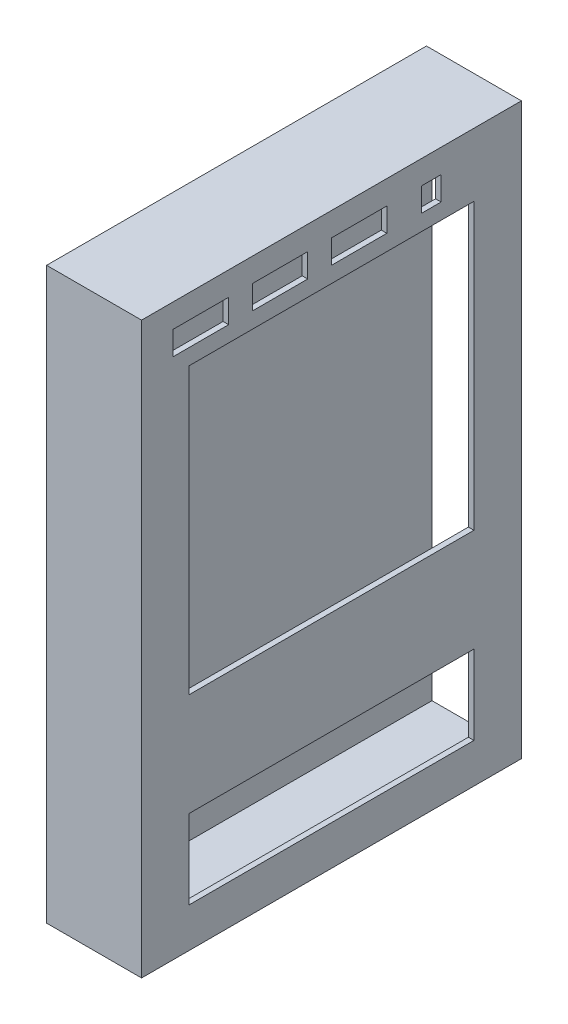
ISO-10303-21;
HEADER;
FILE_DESCRIPTION(('STEP AP214'),'2;1');
FILE_NAME('part.step','',(''),(''),'','','');
FILE_SCHEMA(('AUTOMOTIVE_DESIGN { 1 0 10303 214 1 1 1 1 }'));
ENDSEC;
DATA;
#1=APPLICATION_CONTEXT('core data for automotive mechanical design processes');
#2=APPLICATION_PROTOCOL_DEFINITION('international standard','automotive_design',2000,#1);
#3=PRODUCT_CONTEXT('',#1,'mechanical');
#4=PRODUCT('Part','Part','',(#3));
#5=PRODUCT_RELATED_PRODUCT_CATEGORY('part','',(#4));
#6=PRODUCT_DEFINITION_FORMATION('','',#4);
#7=PRODUCT_DEFINITION_CONTEXT('part definition',#1,'design');
#8=PRODUCT_DEFINITION('design','',#6,#7);
#9=PRODUCT_DEFINITION_SHAPE('','',#8);
#10=(LENGTH_UNIT() NAMED_UNIT(*) SI_UNIT(.MILLI.,.METRE.));
#11=(NAMED_UNIT(*) PLANE_ANGLE_UNIT() SI_UNIT($,.RADIAN.));
#12=(NAMED_UNIT(*) SI_UNIT($,.STERADIAN.) SOLID_ANGLE_UNIT());
#13=UNCERTAINTY_MEASURE_WITH_UNIT(LENGTH_MEASURE(1.E-05),#10,'distance_accuracy_value','');
#14=(GEOMETRIC_REPRESENTATION_CONTEXT(3) GLOBAL_UNCERTAINTY_ASSIGNED_CONTEXT((#13)) GLOBAL_UNIT_ASSIGNED_CONTEXT((#10,
#11,#12)) REPRESENTATION_CONTEXT('',''));
#15=CARTESIAN_POINT('',(0.,0.,0.));
#16=DIRECTION('',(0.,0.,1.));
#17=DIRECTION('',(1.,0.,0.));
#18=AXIS2_PLACEMENT_3D('',#15,#16,#17);
#19=CARTESIAN_POINT('',(-152.4,0.,-304.8));
#20=DIRECTION('',(0.,0.,-1.));
#21=DIRECTION('',(-1.,0.,0.));
#22=AXIS2_PLACEMENT_3D('',#19,#20,#21);
#23=PLANE('',#22);
#24=DIRECTION('',(0.,1.,0.));
#25=VECTOR('',#24,1.);
#26=CARTESIAN_POINT('',(0.,0.,-304.8));
#27=LINE('',#26,#25);
#28=CARTESIAN_POINT('',(0.,0.,-304.8));
#29=VERTEX_POINT('',#28);
#30=CARTESIAN_POINT('',(0.,914.4,-304.8));
#31=VERTEX_POINT('',#30);
#32=EDGE_CURVE('E591',#29,#31,#27,.T.);
#33=ORIENTED_EDGE('',*,*,#32,.F.);
#34=DIRECTION('',(1.,0.,0.));
#35=VECTOR('',#34,1.);
#36=CARTESIAN_POINT('',(-152.4,0.,-304.8));
#37=LINE('',#36,#35);
#38=CARTESIAN_POINT('',(-152.4,0.,-304.8));
#39=VERTEX_POINT('',#38);
#40=EDGE_CURVE('E599',#39,#29,#37,.T.);
#41=ORIENTED_EDGE('',*,*,#40,.F.);
#42=DIRECTION('',(0.,1.,0.));
#43=VECTOR('',#42,1.);
#44=CARTESIAN_POINT('',(-152.4,0.,-304.8));
#45=LINE('',#44,#43);
#46=CARTESIAN_POINT('',(-152.4,914.4,-304.8));
#47=VERTEX_POINT('',#46);
#48=EDGE_CURVE('E576',#39,#47,#45,.T.);
#49=ORIENTED_EDGE('',*,*,#48,.T.);
#50=DIRECTION('',(1.,0.,0.));
#51=VECTOR('',#50,1.);
#52=CARTESIAN_POINT('',(-152.4,914.4,-304.8));
#53=LINE('',#52,#51);
#54=EDGE_CURVE('E53',#47,#31,#53,.T.);
#55=ORIENTED_EDGE('',*,*,#54,.T.);
#56=EDGE_LOOP('',(#33,#41,#49,#55));
#57=FACE_BOUND('',#56,.T.);
#58=DIRECTION('',(1.,0.,0.));
#59=VECTOR('',#58,1.);
#60=CARTESIAN_POINT('',(-152.4,8.89,-304.8));
#61=LINE('',#60,#59);
#62=CARTESIAN_POINT('',(-143.51,8.89,-304.8));
#63=VERTEX_POINT('',#62);
#64=CARTESIAN_POINT('',(-8.89,8.89,-304.8));
#65=VERTEX_POINT('',#64);
#66=EDGE_CURVE('E540',#63,#65,#61,.T.);
#67=ORIENTED_EDGE('',*,*,#66,.T.);
#68=DIRECTION('',(0.,1.,0.));
#69=VECTOR('',#68,1.);
#70=CARTESIAN_POINT('',(-8.89000000000001,0.,-304.8));
#71=LINE('',#70,#69);
#72=CARTESIAN_POINT('',(-8.89,905.51,-304.8));
#73=VERTEX_POINT('',#72);
#74=EDGE_CURVE('E545',#65,#73,#71,.T.);
#75=ORIENTED_EDGE('',*,*,#74,.T.);
#76=DIRECTION('',(1.,0.,0.));
#77=VECTOR('',#76,1.);
#78=CARTESIAN_POINT('',(-152.4,905.51,-304.8));
#79=LINE('',#78,#77);
#80=CARTESIAN_POINT('',(-143.51,905.51,-304.8));
#81=VERTEX_POINT('',#80);
#82=EDGE_CURVE('E530',#81,#73,#79,.T.);
#83=ORIENTED_EDGE('',*,*,#82,.F.);
#84=DIRECTION('',(0.,1.,0.));
#85=VECTOR('',#84,1.);
#86=CARTESIAN_POINT('',(-143.51,0.,-304.8));
#87=LINE('',#86,#85);
#88=EDGE_CURVE('E549',#63,#81,#87,.T.);
#89=ORIENTED_EDGE('',*,*,#88,.F.);
#90=EDGE_LOOP('',(#67,#75,#83,#89));
#91=FACE_BOUND('',#90,.T.);
#92=ADVANCED_FACE('F43',(#57,#91),#23,.T.);
#93=CARTESIAN_POINT('',(-152.4,0.,304.8));
#94=DIRECTION('',(0.,0.,1.));
#95=DIRECTION('',(1.,0.,0.));
#96=AXIS2_PLACEMENT_3D('',#93,#94,#95);
#97=PLANE('',#96);
#98=DIRECTION('',(0.,-1.,0.));
#99=VECTOR('',#98,1.);
#100=CARTESIAN_POINT('',(0.,0.,304.8));
#101=LINE('',#100,#99);
#102=CARTESIAN_POINT('',(0.,914.4,304.8));
#103=VERTEX_POINT('',#102);
#104=CARTESIAN_POINT('',(0.,0.,304.8));
#105=VERTEX_POINT('',#104);
#106=EDGE_CURVE('E529',#103,#105,#101,.T.);
#107=ORIENTED_EDGE('',*,*,#106,.F.);
#108=DIRECTION('',(1.,0.,0.));
#109=VECTOR('',#108,1.);
#110=CARTESIAN_POINT('',(-152.4,914.4,304.8));
#111=LINE('',#110,#109);
#112=CARTESIAN_POINT('',(-152.4,914.4,304.8));
#113=VERTEX_POINT('',#112);
#114=EDGE_CURVE('E11',#113,#103,#111,.T.);
#115=ORIENTED_EDGE('',*,*,#114,.F.);
#116=DIRECTION('',(0.,-1.,0.));
#117=VECTOR('',#116,1.);
#118=CARTESIAN_POINT('',(-152.4,0.,304.8));
#119=LINE('',#118,#117);
#120=CARTESIAN_POINT('',(-152.4,0.,304.8));
#121=VERTEX_POINT('',#120);
#122=EDGE_CURVE('E567',#113,#121,#119,.T.);
#123=ORIENTED_EDGE('',*,*,#122,.T.);
#124=DIRECTION('',(1.,0.,0.));
#125=VECTOR('',#124,1.);
#126=CARTESIAN_POINT('',(-152.4,0.,304.8));
#127=LINE('',#126,#125);
#128=EDGE_CURVE('E47',#121,#105,#127,.T.);
#129=ORIENTED_EDGE('',*,*,#128,.T.);
#130=EDGE_LOOP('',(#107,#115,#123,#129));
#131=FACE_BOUND('',#130,.T.);
#132=ADVANCED_FACE('F45',(#131),#97,.T.);
#133=CARTESIAN_POINT('',(-152.4,914.4,304.8));
#134=DIRECTION('',(0.,1.,0.));
#135=DIRECTION('',(0.,0.,1.));
#136=AXIS2_PLACEMENT_3D('',#133,#134,#135);
#137=PLANE('',#136);
#138=DIRECTION('',(0.,0.,1.));
#139=VECTOR('',#138,1.);
#140=CARTESIAN_POINT('',(0.,914.4,304.8));
#141=LINE('',#140,#139);
#142=EDGE_CURVE('E572',#31,#103,#141,.T.);
#143=ORIENTED_EDGE('',*,*,#142,.F.);
#144=ORIENTED_EDGE('',*,*,#54,.F.);
#145=DIRECTION('',(0.,0.,1.));
#146=VECTOR('',#145,1.);
#147=CARTESIAN_POINT('',(-152.4,914.4,304.8));
#148=LINE('',#147,#146);
#149=EDGE_CURVE('E580',#47,#113,#148,.T.);
#150=ORIENTED_EDGE('',*,*,#149,.T.);
#151=ORIENTED_EDGE('',*,*,#114,.T.);
#152=EDGE_LOOP('',(#143,#144,#150,#151));
#153=FACE_BOUND('',#152,.T.);
#154=ADVANCED_FACE('F614',(#153),#137,.T.);
#155=CARTESIAN_POINT('',(-152.4,0.,304.8));
#156=DIRECTION('',(0.,-1.,0.));
#157=DIRECTION('',(0.,0.,-1.));
#158=AXIS2_PLACEMENT_3D('',#155,#156,#157);
#159=PLANE('',#158);
#160=DIRECTION('',(0.,0.,-1.));
#161=VECTOR('',#160,1.);
#162=CARTESIAN_POINT('',(0.,0.,304.8));
#163=LINE('',#162,#161);
#164=EDGE_CURVE('E587',#105,#29,#163,.T.);
#165=ORIENTED_EDGE('',*,*,#164,.F.);
#166=ORIENTED_EDGE('',*,*,#128,.F.);
#167=DIRECTION('',(0.,0.,-1.));
#168=VECTOR('',#167,1.);
#169=CARTESIAN_POINT('',(-152.4,0.,304.8));
#170=LINE('',#169,#168);
#171=EDGE_CURVE('E571',#121,#39,#170,.T.);
#172=ORIENTED_EDGE('',*,*,#171,.T.);
#173=ORIENTED_EDGE('',*,*,#40,.T.);
#174=EDGE_LOOP('',(#165,#166,#172,#173));
#175=FACE_BOUND('',#174,.T.);
#176=ADVANCED_FACE('F609',(#175),#159,.T.);
#177=CARTESIAN_POINT('',(-152.4,0.,0.));
#178=DIRECTION('',(-1.,0.,0.));
#179=DIRECTION('',(0.,0.,1.));
#180=AXIS2_PLACEMENT_3D('',#177,#178,#179);
#181=PLANE('',#180);
#182=ORIENTED_EDGE('',*,*,#122,.F.);
#183=ORIENTED_EDGE('',*,*,#149,.F.);
#184=ORIENTED_EDGE('',*,*,#48,.F.);
#185=ORIENTED_EDGE('',*,*,#171,.F.);
#186=EDGE_LOOP('',(#182,#183,#184,#185));
#187=FACE_BOUND('',#186,.T.);
#188=ADVANCED_FACE('F617',(#187),#181,.T.);
#189=CARTESIAN_POINT('',(0.,0.,0.));
#190=DIRECTION('',(-1.,0.,0.));
#191=DIRECTION('',(0.,0.,1.));
#192=AXIS2_PLACEMENT_3D('',#189,#190,#191);
#193=PLANE('',#192);
#194=DIRECTION('',(0.,1.,0.));
#195=VECTOR('',#194,1.);
#196=CARTESIAN_POINT('',(0.,838.2,165.1));
#197=LINE('',#196,#195);
#198=CARTESIAN_POINT('',(0.,838.2,165.1));
#199=VERTEX_POINT('',#198);
#200=CARTESIAN_POINT('',(0.,876.3,165.1));
#201=VERTEX_POINT('',#200);
#202=EDGE_CURVE('E284',#199,#201,#197,.T.);
#203=ORIENTED_EDGE('',*,*,#202,.F.);
#204=DIRECTION('',(0.,0.,-1.));
#205=VECTOR('',#204,1.);
#206=CARTESIAN_POINT('',(0.,838.2,254.));
#207=LINE('',#206,#205);
#208=CARTESIAN_POINT('',(0.,838.2,254.));
#209=VERTEX_POINT('',#208);
#210=EDGE_CURVE('E274',#209,#199,#207,.T.);
#211=ORIENTED_EDGE('',*,*,#210,.F.);
#212=DIRECTION('',(0.,-1.,0.));
#213=VECTOR('',#212,1.);
#214=CARTESIAN_POINT('',(0.,838.2,254.));
#215=LINE('',#214,#213);
#216=CARTESIAN_POINT('',(0.,876.3,254.));
#217=VERTEX_POINT('',#216);
#218=EDGE_CURVE('E288',#217,#209,#215,.T.);
#219=ORIENTED_EDGE('',*,*,#218,.F.);
#220=DIRECTION('',(0.,0.,1.));
#221=VECTOR('',#220,1.);
#222=CARTESIAN_POINT('',(0.,876.3,254.));
#223=LINE('',#222,#221);
#224=EDGE_CURVE('E61',#201,#217,#223,.T.);
#225=ORIENTED_EDGE('',*,*,#224,.F.);
#226=EDGE_LOOP('',(#203,#211,#219,#225));
#227=FACE_BOUND('',#226,.T.);
#228=DIRECTION('',(0.,0.,1.));
#229=VECTOR('',#228,1.);
#230=CARTESIAN_POINT('',(0.,876.3,0.));
#231=LINE('',#230,#229);
#232=CARTESIAN_POINT('',(0.,876.3,-88.8999999999999));
#233=VERTEX_POINT('',#232);
#234=CARTESIAN_POINT('',(0.,876.3,0.));
#235=VERTEX_POINT('',#234);
#236=EDGE_CURVE('E341',#233,#235,#231,.T.);
#237=ORIENTED_EDGE('',*,*,#236,.F.);
#238=DIRECTION('',(0.,1.,0.));
#239=VECTOR('',#238,1.);
#240=CARTESIAN_POINT('',(0.,838.2,-88.8999999999999));
#241=LINE('',#240,#239);
#242=CARTESIAN_POINT('',(0.,838.2,-88.8999999999999));
#243=VERTEX_POINT('',#242);
#244=EDGE_CURVE('E337',#243,#233,#241,.T.);
#245=ORIENTED_EDGE('',*,*,#244,.F.);
#246=DIRECTION('',(0.,0.,-1.));
#247=VECTOR('',#246,1.);
#248=CARTESIAN_POINT('',(0.,838.2,0.));
#249=LINE('',#248,#247);
#250=CARTESIAN_POINT('',(0.,838.2,0.));
#251=VERTEX_POINT('',#250);
#252=EDGE_CURVE('E332',#251,#243,#249,.T.);
#253=ORIENTED_EDGE('',*,*,#252,.F.);
#254=DIRECTION('',(0.,-1.,0.));
#255=VECTOR('',#254,1.);
#256=CARTESIAN_POINT('',(0.,838.2,0.));
#257=LINE('',#256,#255);
#258=EDGE_CURVE('E69',#235,#251,#257,.T.);
#259=ORIENTED_EDGE('',*,*,#258,.F.);
#260=EDGE_LOOP('',(#237,#245,#253,#259));
#261=FACE_BOUND('',#260,.T.);
#262=DIRECTION('',(0.,1.,0.));
#263=VECTOR('',#262,1.);
#264=CARTESIAN_POINT('',(0.,838.2,-175.901262688416));
#265=LINE('',#264,#263);
#266=CARTESIAN_POINT('',(0.,838.2,-175.901262688416));
#267=VERTEX_POINT('',#266);
#268=CARTESIAN_POINT('',(0.,876.3,-175.901262688416));
#269=VERTEX_POINT('',#268);
#270=EDGE_CURVE('E428',#267,#269,#265,.T.);
#271=ORIENTED_EDGE('',*,*,#270,.F.);
#272=DIRECTION('',(0.,0.,-1.));
#273=VECTOR('',#272,1.);
#274=CARTESIAN_POINT('',(0.,838.2,-144.151262688416));
#275=LINE('',#274,#273);
#276=CARTESIAN_POINT('',(0.,838.2,-144.151262688416));
#277=VERTEX_POINT('',#276);
#278=EDGE_CURVE('E424',#277,#267,#275,.T.);
#279=ORIENTED_EDGE('',*,*,#278,.F.);
#280=DIRECTION('',(0.,-1.,0.));
#281=VECTOR('',#280,1.);
#282=CARTESIAN_POINT('',(0.,838.2,-144.151262688416));
#283=LINE('',#282,#281);
#284=CARTESIAN_POINT('',(0.,876.3,-144.151262688416));
#285=VERTEX_POINT('',#284);
#286=EDGE_CURVE('E351',#285,#277,#283,.T.);
#287=ORIENTED_EDGE('',*,*,#286,.F.);
#288=DIRECTION('',(0.,0.,1.));
#289=VECTOR('',#288,1.);
#290=CARTESIAN_POINT('',(0.,876.3,-144.151262688416));
#291=LINE('',#290,#289);
#292=EDGE_CURVE('E420',#269,#285,#291,.T.);
#293=ORIENTED_EDGE('',*,*,#292,.F.);
#294=EDGE_LOOP('',(#271,#279,#287,#293));
#295=FACE_BOUND('',#294,.T.);
#296=DIRECTION('',(0.,0.,1.));
#297=VECTOR('',#296,1.);
#298=CARTESIAN_POINT('',(0.,876.3,127.));
#299=LINE('',#298,#297);
#300=CARTESIAN_POINT('',(0.,876.3,38.1000000000001));
#301=VERTEX_POINT('',#300);
#302=CARTESIAN_POINT('',(0.,876.3,127.));
#303=VERTEX_POINT('',#302);
#304=EDGE_CURVE('E386',#301,#303,#299,.T.);
#305=ORIENTED_EDGE('',*,*,#304,.F.);
#306=DIRECTION('',(0.,1.,0.));
#307=VECTOR('',#306,1.);
#308=CARTESIAN_POINT('',(0.,838.2,38.1000000000001));
#309=LINE('',#308,#307);
#310=CARTESIAN_POINT('',(0.,838.2,38.1000000000001));
#311=VERTEX_POINT('',#310);
#312=EDGE_CURVE('E382',#311,#301,#309,.T.);
#313=ORIENTED_EDGE('',*,*,#312,.F.);
#314=DIRECTION('',(0.,0.,-1.));
#315=VECTOR('',#314,1.);
#316=CARTESIAN_POINT('',(0.,838.2,127.));
#317=LINE('',#316,#315);
#318=CARTESIAN_POINT('',(0.,838.2,127.));
#319=VERTEX_POINT('',#318);
#320=EDGE_CURVE('E378',#319,#311,#317,.T.);
#321=ORIENTED_EDGE('',*,*,#320,.F.);
#322=DIRECTION('',(0.,-1.,0.));
#323=VECTOR('',#322,1.);
#324=CARTESIAN_POINT('',(0.,838.2,127.));
#325=LINE('',#324,#323);
#326=EDGE_CURVE('E377',#303,#319,#325,.T.);
#327=ORIENTED_EDGE('',*,*,#326,.F.);
#328=EDGE_LOOP('',(#305,#313,#321,#327));
#329=FACE_BOUND('',#328,.T.);
#330=DIRECTION('',(0.,1.,0.));
#331=VECTOR('',#330,1.);
#332=CARTESIAN_POINT('',(0.,812.8,-228.6));
#333=LINE('',#332,#331);
#334=CARTESIAN_POINT('',(0.,355.6,-228.6));
#335=VERTEX_POINT('',#334);
#336=CARTESIAN_POINT('',(0.,812.8,-228.6));
#337=VERTEX_POINT('',#336);
#338=EDGE_CURVE('E438',#335,#337,#333,.T.);
#339=ORIENTED_EDGE('',*,*,#338,.F.);
#340=DIRECTION('',(0.,0.,-1.));
#341=VECTOR('',#340,1.);
#342=CARTESIAN_POINT('',(0.,355.6,228.6));
#343=LINE('',#342,#341);
#344=CARTESIAN_POINT('',(0.,355.6,228.6));
#345=VERTEX_POINT('',#344);
#346=EDGE_CURVE('E442',#345,#335,#343,.T.);
#347=ORIENTED_EDGE('',*,*,#346,.F.);
#348=DIRECTION('',(0.,-1.,0.));
#349=VECTOR('',#348,1.);
#350=CARTESIAN_POINT('',(0.,812.8,228.6));
#351=LINE('',#350,#349);
#352=CARTESIAN_POINT('',(0.,812.8,228.6));
#353=VERTEX_POINT('',#352);
#354=EDGE_CURVE('E303',#353,#345,#351,.T.);
#355=ORIENTED_EDGE('',*,*,#354,.F.);
#356=DIRECTION('',(0.,0.,1.));
#357=VECTOR('',#356,1.);
#358=CARTESIAN_POINT('',(0.,812.8,228.6));
#359=LINE('',#358,#357);
#360=EDGE_CURVE('E434',#337,#353,#359,.T.);
#361=ORIENTED_EDGE('',*,*,#360,.F.);
#362=EDGE_LOOP('',(#339,#347,#355,#361));
#363=FACE_BOUND('',#362,.T.);
#364=DIRECTION('',(0.,1.,0.));
#365=VECTOR('',#364,1.);
#366=CARTESIAN_POINT('',(0.,63.5,-228.6));
#367=LINE('',#366,#365);
#368=CARTESIAN_POINT('',(0.,63.5,-228.6));
#369=VERTEX_POINT('',#368);
#370=CARTESIAN_POINT('',(0.,190.5,-228.6));
#371=VERTEX_POINT('',#370);
#372=EDGE_CURVE('E482',#369,#371,#367,.T.);
#373=ORIENTED_EDGE('',*,*,#372,.F.);
#374=DIRECTION('',(0.,0.,-1.));
#375=VECTOR('',#374,1.);
#376=CARTESIAN_POINT('',(0.,63.5,228.6));
#377=LINE('',#376,#375);
#378=CARTESIAN_POINT('',(0.,63.5,228.6));
#379=VERTEX_POINT('',#378);
#380=EDGE_CURVE('E486',#379,#369,#377,.T.);
#381=ORIENTED_EDGE('',*,*,#380,.F.);
#382=DIRECTION('',(0.,-1.,0.));
#383=VECTOR('',#382,1.);
#384=CARTESIAN_POINT('',(0.,63.5,228.6));
#385=LINE('',#384,#383);
#386=CARTESIAN_POINT('',(0.,190.5,228.6));
#387=VERTEX_POINT('',#386);
#388=EDGE_CURVE('E477',#387,#379,#385,.T.);
#389=ORIENTED_EDGE('',*,*,#388,.F.);
#390=DIRECTION('',(0.,0.,1.));
#391=VECTOR('',#390,1.);
#392=CARTESIAN_POINT('',(0.,190.5,228.6));
#393=LINE('',#392,#391);
#394=EDGE_CURVE('E478',#371,#387,#393,.T.);
#395=ORIENTED_EDGE('',*,*,#394,.F.);
#396=EDGE_LOOP('',(#373,#381,#389,#395));
#397=FACE_BOUND('',#396,.T.);
#398=ORIENTED_EDGE('',*,*,#106,.T.);
#399=ORIENTED_EDGE('',*,*,#164,.T.);
#400=ORIENTED_EDGE('',*,*,#32,.T.);
#401=ORIENTED_EDGE('',*,*,#142,.T.);
#402=EDGE_LOOP('',(#398,#399,#400,#401));
#403=FACE_BOUND('',#402,.T.);
#404=ADVANCED_FACE('F611',(#227,#261,#295,#329,#363,#397,#403),#193,.F.);
#405=CARTESIAN_POINT('',(-152.4,0.,295.91));
#406=DIRECTION('',(0.,0.,1.));
#407=DIRECTION('',(1.,0.,0.));
#408=AXIS2_PLACEMENT_3D('',#405,#406,#407);
#409=PLANE('',#408);
#410=DIRECTION('',(0.,-1.,0.));
#411=VECTOR('',#410,1.);
#412=CARTESIAN_POINT('',(-8.89000000000001,0.,295.91));
#413=LINE('',#412,#411);
#414=CARTESIAN_POINT('',(-8.89,905.51,295.91));
#415=VERTEX_POINT('',#414);
#416=CARTESIAN_POINT('',(-8.89,8.89,295.91));
#417=VERTEX_POINT('',#416);
#418=EDGE_CURVE('E521',#415,#417,#413,.T.);
#419=ORIENTED_EDGE('',*,*,#418,.T.);
#420=DIRECTION('',(1.,0.,0.));
#421=VECTOR('',#420,1.);
#422=CARTESIAN_POINT('',(-152.4,8.89,295.91));
#423=LINE('',#422,#421);
#424=CARTESIAN_POINT('',(-143.51,8.89,295.91));
#425=VERTEX_POINT('',#424);
#426=EDGE_CURVE('E537',#425,#417,#423,.T.);
#427=ORIENTED_EDGE('',*,*,#426,.F.);
#428=DIRECTION('',(0.,-1.,0.));
#429=VECTOR('',#428,1.);
#430=CARTESIAN_POINT('',(-143.51,0.,295.91));
#431=LINE('',#430,#429);
#432=CARTESIAN_POINT('',(-143.51,905.51,295.91));
#433=VERTEX_POINT('',#432);
#434=EDGE_CURVE('E531',#433,#425,#431,.T.);
#435=ORIENTED_EDGE('',*,*,#434,.F.);
#436=DIRECTION('',(1.,0.,0.));
#437=VECTOR('',#436,1.);
#438=CARTESIAN_POINT('',(-152.4,905.51,295.91));
#439=LINE('',#438,#437);
#440=EDGE_CURVE('E526',#433,#415,#439,.T.);
#441=ORIENTED_EDGE('',*,*,#440,.T.);
#442=EDGE_LOOP('',(#419,#427,#435,#441));
#443=FACE_BOUND('',#442,.T.);
#444=ADVANCED_FACE('F633',(#443),#409,.F.);
#445=CARTESIAN_POINT('',(-152.4,905.51,304.8));
#446=DIRECTION('',(0.,1.,0.));
#447=DIRECTION('',(0.,0.,1.));
#448=AXIS2_PLACEMENT_3D('',#445,#446,#447);
#449=PLANE('',#448);
#450=DIRECTION('',(0.,0.,1.));
#451=VECTOR('',#450,1.);
#452=CARTESIAN_POINT('',(-8.89000000000001,905.51,304.8));
#453=LINE('',#452,#451);
#454=EDGE_CURVE('E536',#73,#415,#453,.T.);
#455=ORIENTED_EDGE('',*,*,#454,.T.);
#456=ORIENTED_EDGE('',*,*,#440,.F.);
#457=DIRECTION('',(0.,0.,1.));
#458=VECTOR('',#457,1.);
#459=CARTESIAN_POINT('',(-143.51,905.51,304.8));
#460=LINE('',#459,#458);
#461=EDGE_CURVE('E541',#81,#433,#460,.T.);
#462=ORIENTED_EDGE('',*,*,#461,.F.);
#463=ORIENTED_EDGE('',*,*,#82,.T.);
#464=EDGE_LOOP('',(#455,#456,#462,#463));
#465=FACE_BOUND('',#464,.T.);
#466=ADVANCED_FACE('F638',(#465),#449,.F.);
#467=CARTESIAN_POINT('',(-152.4,8.89,304.8));
#468=DIRECTION('',(0.,-1.,0.));
#469=DIRECTION('',(0.,0.,-1.));
#470=AXIS2_PLACEMENT_3D('',#467,#468,#469);
#471=PLANE('',#470);
#472=DIRECTION('',(0.,0.,-1.));
#473=VECTOR('',#472,1.);
#474=CARTESIAN_POINT('',(-8.89000000000001,8.89,304.8));
#475=LINE('',#474,#473);
#476=EDGE_CURVE('E525',#417,#65,#475,.T.);
#477=ORIENTED_EDGE('',*,*,#476,.T.);
#478=ORIENTED_EDGE('',*,*,#66,.F.);
#479=DIRECTION('',(0.,0.,-1.));
#480=VECTOR('',#479,1.);
#481=CARTESIAN_POINT('',(-143.51,8.89,304.8));
#482=LINE('',#481,#480);
#483=EDGE_CURVE('E535',#425,#63,#482,.T.);
#484=ORIENTED_EDGE('',*,*,#483,.F.);
#485=ORIENTED_EDGE('',*,*,#426,.T.);
#486=EDGE_LOOP('',(#477,#478,#484,#485));
#487=FACE_BOUND('',#486,.T.);
#488=ADVANCED_FACE('F627',(#487),#471,.F.);
#489=CARTESIAN_POINT('',(-143.51,0.,0.));
#490=DIRECTION('',(-1.,0.,0.));
#491=DIRECTION('',(0.,0.,1.));
#492=AXIS2_PLACEMENT_3D('',#489,#490,#491);
#493=PLANE('',#492);
#494=ORIENTED_EDGE('',*,*,#434,.T.);
#495=ORIENTED_EDGE('',*,*,#483,.T.);
#496=ORIENTED_EDGE('',*,*,#88,.T.);
#497=ORIENTED_EDGE('',*,*,#461,.T.);
#498=EDGE_LOOP('',(#494,#495,#496,#497));
#499=FACE_BOUND('',#498,.T.);
#500=ADVANCED_FACE('F630',(#499),#493,.F.);
#501=CARTESIAN_POINT('',(-8.89,0.,0.));
#502=DIRECTION('',(-1.,0.,0.));
#503=DIRECTION('',(0.,0.,1.));
#504=AXIS2_PLACEMENT_3D('',#501,#502,#503);
#505=PLANE('',#504);
#506=DIRECTION('',(0.,0.,-1.));
#507=VECTOR('',#506,1.);
#508=CARTESIAN_POINT('',(-8.89,838.2,254.));
#509=LINE('',#508,#507);
#510=CARTESIAN_POINT('',(-8.89,838.2,254.));
#511=VERTEX_POINT('',#510);
#512=CARTESIAN_POINT('',(-8.89,838.2,165.1));
#513=VERTEX_POINT('',#512);
#514=EDGE_CURVE('E271',#511,#513,#509,.T.);
#515=ORIENTED_EDGE('',*,*,#514,.T.);
#516=DIRECTION('',(0.,1.,0.));
#517=VECTOR('',#516,1.);
#518=CARTESIAN_POINT('',(-8.89,838.2,165.1));
#519=LINE('',#518,#517);
#520=CARTESIAN_POINT('',(-8.89,876.3,165.1));
#521=VERTEX_POINT('',#520);
#522=EDGE_CURVE('E256',#513,#521,#519,.T.);
#523=ORIENTED_EDGE('',*,*,#522,.T.);
#524=DIRECTION('',(0.,0.,1.));
#525=VECTOR('',#524,1.);
#526=CARTESIAN_POINT('',(-8.89,876.3,254.));
#527=LINE('',#526,#525);
#528=CARTESIAN_POINT('',(-8.89,876.3,254.));
#529=VERTEX_POINT('',#528);
#530=EDGE_CURVE('E294',#521,#529,#527,.T.);
#531=ORIENTED_EDGE('',*,*,#530,.T.);
#532=DIRECTION('',(0.,-1.,0.));
#533=VECTOR('',#532,1.);
#534=CARTESIAN_POINT('',(-8.89,838.2,254.));
#535=LINE('',#534,#533);
#536=EDGE_CURVE('E280',#529,#511,#535,.T.);
#537=ORIENTED_EDGE('',*,*,#536,.T.);
#538=EDGE_LOOP('',(#515,#523,#531,#537));
#539=FACE_BOUND('',#538,.T.);
#540=DIRECTION('',(0.,1.,0.));
#541=VECTOR('',#540,1.);
#542=CARTESIAN_POINT('',(-8.89,838.2,-88.8999999999999));
#543=LINE('',#542,#541);
#544=CARTESIAN_POINT('',(-8.89,838.2,-88.8999999999999));
#545=VERTEX_POINT('',#544);
#546=CARTESIAN_POINT('',(-8.89,876.3,-88.8999999999999));
#547=VERTEX_POINT('',#546);
#548=EDGE_CURVE('E311',#545,#547,#543,.T.);
#549=ORIENTED_EDGE('',*,*,#548,.T.);
#550=DIRECTION('',(0.,0.,1.));
#551=VECTOR('',#550,1.);
#552=CARTESIAN_POINT('',(-8.89,876.3,0.));
#553=LINE('',#552,#551);
#554=CARTESIAN_POINT('',(-8.89,876.3,0.));
#555=VERTEX_POINT('',#554);
#556=EDGE_CURVE('E312',#547,#555,#553,.T.);
#557=ORIENTED_EDGE('',*,*,#556,.T.);
#558=DIRECTION('',(0.,-1.,0.));
#559=VECTOR('',#558,1.);
#560=CARTESIAN_POINT('',(-8.89,838.2,0.));
#561=LINE('',#560,#559);
#562=CARTESIAN_POINT('',(-8.89,838.2,0.));
#563=VERTEX_POINT('',#562);
#564=EDGE_CURVE('E316',#555,#563,#561,.T.);
#565=ORIENTED_EDGE('',*,*,#564,.T.);
#566=DIRECTION('',(0.,0.,-1.));
#567=VECTOR('',#566,1.);
#568=CARTESIAN_POINT('',(-8.89,838.2,0.));
#569=LINE('',#568,#567);
#570=EDGE_CURVE('E307',#563,#545,#569,.T.);
#571=ORIENTED_EDGE('',*,*,#570,.T.);
#572=EDGE_LOOP('',(#549,#557,#565,#571));
#573=FACE_BOUND('',#572,.T.);
#574=DIRECTION('',(0.,0.,-1.));
#575=VECTOR('',#574,1.);
#576=CARTESIAN_POINT('',(-8.89,838.2,-144.151262688416));
#577=LINE('',#576,#575);
#578=CARTESIAN_POINT('',(-8.89,838.2,-144.151262688416));
#579=VERTEX_POINT('',#578);
#580=CARTESIAN_POINT('',(-8.89,838.2,-175.901262688416));
#581=VERTEX_POINT('',#580);
#582=EDGE_CURVE('E398',#579,#581,#577,.T.);
#583=ORIENTED_EDGE('',*,*,#582,.T.);
#584=DIRECTION('',(0.,1.,0.));
#585=VECTOR('',#584,1.);
#586=CARTESIAN_POINT('',(-8.89,838.2,-175.901262688416));
#587=LINE('',#586,#585);
#588=CARTESIAN_POINT('',(-8.89,876.3,-175.901262688416));
#589=VERTEX_POINT('',#588);
#590=EDGE_CURVE('E399',#581,#589,#587,.T.);
#591=ORIENTED_EDGE('',*,*,#590,.T.);
#592=DIRECTION('',(0.,0.,1.));
#593=VECTOR('',#592,1.);
#594=CARTESIAN_POINT('',(-8.89,876.3,-144.151262688416));
#595=LINE('',#594,#593);
#596=CARTESIAN_POINT('',(-8.89,876.3,-144.151262688416));
#597=VERTEX_POINT('',#596);
#598=EDGE_CURVE('E403',#589,#597,#595,.T.);
#599=ORIENTED_EDGE('',*,*,#598,.T.);
#600=DIRECTION('',(0.,-1.,0.));
#601=VECTOR('',#600,1.);
#602=CARTESIAN_POINT('',(-8.89,838.2,-144.151262688416));
#603=LINE('',#602,#601);
#604=EDGE_CURVE('E394',#597,#579,#603,.T.);
#605=ORIENTED_EDGE('',*,*,#604,.T.);
#606=EDGE_LOOP('',(#583,#591,#599,#605));
#607=FACE_BOUND('',#606,.T.);
#608=DIRECTION('',(0.,1.,0.));
#609=VECTOR('',#608,1.);
#610=CARTESIAN_POINT('',(-8.89,838.2,38.1000000000001));
#611=LINE('',#610,#609);
#612=CARTESIAN_POINT('',(-8.89,838.2,38.1000000000001));
#613=VERTEX_POINT('',#612);
#614=CARTESIAN_POINT('',(-8.89,876.3,38.1000000000001));
#615=VERTEX_POINT('',#614);
#616=EDGE_CURVE('E355',#613,#615,#611,.T.);
#617=ORIENTED_EDGE('',*,*,#616,.T.);
#618=DIRECTION('',(0.,0.,1.));
#619=VECTOR('',#618,1.);
#620=CARTESIAN_POINT('',(-8.89,876.3,127.));
#621=LINE('',#620,#619);
#622=CARTESIAN_POINT('',(-8.89,876.3,127.));
#623=VERTEX_POINT('',#622);
#624=EDGE_CURVE('E356',#615,#623,#621,.T.);
#625=ORIENTED_EDGE('',*,*,#624,.T.);
#626=DIRECTION('',(0.,-1.,0.));
#627=VECTOR('',#626,1.);
#628=CARTESIAN_POINT('',(-8.89,838.2,127.));
#629=LINE('',#628,#627);
#630=CARTESIAN_POINT('',(-8.89,838.2,127.));
#631=VERTEX_POINT('',#630);
#632=EDGE_CURVE('E360',#623,#631,#629,.T.);
#633=ORIENTED_EDGE('',*,*,#632,.T.);
#634=DIRECTION('',(0.,0.,-1.));
#635=VECTOR('',#634,1.);
#636=CARTESIAN_POINT('',(-8.89,838.2,127.));
#637=LINE('',#636,#635);
#638=EDGE_CURVE('E350',#631,#613,#637,.T.);
#639=ORIENTED_EDGE('',*,*,#638,.T.);
#640=EDGE_LOOP('',(#617,#625,#633,#639));
#641=FACE_BOUND('',#640,.T.);
#642=DIRECTION('',(0.,0.,-1.));
#643=VECTOR('',#642,1.);
#644=CARTESIAN_POINT('',(-8.88999999999995,355.6,228.6));
#645=LINE('',#644,#643);
#646=CARTESIAN_POINT('',(-8.89,355.6,228.6));
#647=VERTEX_POINT('',#646);
#648=CARTESIAN_POINT('',(-8.88999999999995,355.6,-228.6));
#649=VERTEX_POINT('',#648);
#650=EDGE_CURVE('E437',#647,#649,#645,.T.);
#651=ORIENTED_EDGE('',*,*,#650,.T.);
#652=DIRECTION('',(0.,1.,0.));
#653=VECTOR('',#652,1.);
#654=CARTESIAN_POINT('',(-8.88999999999995,812.8,-228.6));
#655=LINE('',#654,#653);
#656=CARTESIAN_POINT('',(-8.88999999999995,812.8,-228.6));
#657=VERTEX_POINT('',#656);
#658=EDGE_CURVE('E464',#649,#657,#655,.T.);
#659=ORIENTED_EDGE('',*,*,#658,.T.);
#660=DIRECTION('',(0.,0.,1.));
#661=VECTOR('',#660,1.);
#662=CARTESIAN_POINT('',(-8.88999999999995,812.8,228.6));
#663=LINE('',#662,#661);
#664=CARTESIAN_POINT('',(-8.88999999999995,812.8,228.6));
#665=VERTEX_POINT('',#664);
#666=EDGE_CURVE('E459',#657,#665,#663,.T.);
#667=ORIENTED_EDGE('',*,*,#666,.T.);
#668=DIRECTION('',(0.,-1.,0.));
#669=VECTOR('',#668,1.);
#670=CARTESIAN_POINT('',(-8.88999999999995,812.8,228.6));
#671=LINE('',#670,#669);
#672=EDGE_CURVE('E453',#665,#647,#671,.T.);
#673=ORIENTED_EDGE('',*,*,#672,.T.);
#674=EDGE_LOOP('',(#651,#659,#667,#673));
#675=FACE_BOUND('',#674,.T.);
#676=DIRECTION('',(0.,0.,-1.));
#677=VECTOR('',#676,1.);
#678=CARTESIAN_POINT('',(-8.89000000000001,63.5,228.6));
#679=LINE('',#678,#677);
#680=CARTESIAN_POINT('',(-8.89,63.5,228.6));
#681=VERTEX_POINT('',#680);
#682=CARTESIAN_POINT('',(-8.89000000000001,63.5,-228.6));
#683=VERTEX_POINT('',#682);
#684=EDGE_CURVE('E481',#681,#683,#679,.T.);
#685=ORIENTED_EDGE('',*,*,#684,.T.);
#686=DIRECTION('',(0.,1.,0.));
#687=VECTOR('',#686,1.);
#688=CARTESIAN_POINT('',(-8.89000000000001,63.5,-228.6));
#689=LINE('',#688,#687);
#690=CARTESIAN_POINT('',(-8.89000000000001,190.5,-228.6));
#691=VERTEX_POINT('',#690);
#692=EDGE_CURVE('E508',#683,#691,#689,.T.);
#693=ORIENTED_EDGE('',*,*,#692,.T.);
#694=DIRECTION('',(0.,0.,1.));
#695=VECTOR('',#694,1.);
#696=CARTESIAN_POINT('',(-8.89000000000001,190.5,228.6));
#697=LINE('',#696,#695);
#698=CARTESIAN_POINT('',(-8.89000000000001,190.5,228.6));
#699=VERTEX_POINT('',#698);
#700=EDGE_CURVE('E503',#691,#699,#697,.T.);
#701=ORIENTED_EDGE('',*,*,#700,.T.);
#702=DIRECTION('',(0.,-1.,0.));
#703=VECTOR('',#702,1.);
#704=CARTESIAN_POINT('',(-8.89000000000001,63.5,228.6));
#705=LINE('',#704,#703);
#706=EDGE_CURVE('E497',#699,#681,#705,.T.);
#707=ORIENTED_EDGE('',*,*,#706,.T.);
#708=EDGE_LOOP('',(#685,#693,#701,#707));
#709=FACE_BOUND('',#708,.T.);
#710=ORIENTED_EDGE('',*,*,#418,.F.);
#711=ORIENTED_EDGE('',*,*,#454,.F.);
#712=ORIENTED_EDGE('',*,*,#74,.F.);
#713=ORIENTED_EDGE('',*,*,#476,.F.);
#714=EDGE_LOOP('',(#710,#711,#712,#713));
#715=FACE_BOUND('',#714,.T.);
#716=ADVANCED_FACE('F278',(#539,#573,#607,#641,#675,#709,#715),#505,.T.);
#717=CARTESIAN_POINT('',(-483.401158983643,63.5,228.6));
#718=DIRECTION('',(0.,-1.,0.));
#719=DIRECTION('',(0.,0.,-1.));
#720=AXIS2_PLACEMENT_3D('',#717,#718,#719);
#721=PLANE('',#720);
#722=DIRECTION('',(1.,0.,0.));
#723=VECTOR('',#722,1.);
#724=CARTESIAN_POINT('',(-483.401158983643,63.5,228.6));
#725=LINE('',#724,#723);
#726=EDGE_CURVE('E501',#681,#379,#725,.T.);
#727=ORIENTED_EDGE('',*,*,#726,.T.);
#728=ORIENTED_EDGE('',*,*,#380,.T.);
#729=DIRECTION('',(1.,0.,0.));
#730=VECTOR('',#729,1.);
#731=CARTESIAN_POINT('',(-483.401158983643,63.5,-228.6));
#732=LINE('',#731,#730);
#733=EDGE_CURVE('E496',#683,#369,#732,.T.);
#734=ORIENTED_EDGE('',*,*,#733,.F.);
#735=ORIENTED_EDGE('',*,*,#684,.F.);
#736=EDGE_LOOP('',(#727,#728,#734,#735));
#737=FACE_BOUND('',#736,.T.);
#738=ADVANCED_FACE('F653',(#737),#721,.F.);
#739=CARTESIAN_POINT('',(-483.401158983643,63.5,-228.6));
#740=DIRECTION('',(0.,0.,-1.));
#741=DIRECTION('',(-1.,0.,0.));
#742=AXIS2_PLACEMENT_3D('',#739,#740,#741);
#743=PLANE('',#742);
#744=ORIENTED_EDGE('',*,*,#733,.T.);
#745=ORIENTED_EDGE('',*,*,#372,.T.);
#746=DIRECTION('',(1.,0.,0.));
#747=VECTOR('',#746,1.);
#748=CARTESIAN_POINT('',(-483.401158983643,190.5,-228.6));
#749=LINE('',#748,#747);
#750=EDGE_CURVE('E507',#691,#371,#749,.T.);
#751=ORIENTED_EDGE('',*,*,#750,.F.);
#752=ORIENTED_EDGE('',*,*,#692,.F.);
#753=EDGE_LOOP('',(#744,#745,#751,#752));
#754=FACE_BOUND('',#753,.T.);
#755=ADVANCED_FACE('F714',(#754),#743,.F.);
#756=CARTESIAN_POINT('',(-483.401158983643,190.5,228.6));
#757=DIRECTION('',(0.,1.,0.));
#758=DIRECTION('',(0.,0.,1.));
#759=AXIS2_PLACEMENT_3D('',#756,#757,#758);
#760=PLANE('',#759);
#761=ORIENTED_EDGE('',*,*,#750,.T.);
#762=ORIENTED_EDGE('',*,*,#394,.T.);
#763=DIRECTION('',(1.,0.,0.));
#764=VECTOR('',#763,1.);
#765=CARTESIAN_POINT('',(-483.401158983643,190.5,228.6));
#766=LINE('',#765,#764);
#767=EDGE_CURVE('E502',#699,#387,#766,.T.);
#768=ORIENTED_EDGE('',*,*,#767,.F.);
#769=ORIENTED_EDGE('',*,*,#700,.F.);
#770=EDGE_LOOP('',(#761,#762,#768,#769));
#771=FACE_BOUND('',#770,.T.);
#772=ADVANCED_FACE('F724',(#771),#760,.F.);
#773=CARTESIAN_POINT('',(-483.401158983643,63.5,228.6));
#774=DIRECTION('',(0.,0.,1.));
#775=DIRECTION('',(1.,0.,0.));
#776=AXIS2_PLACEMENT_3D('',#773,#774,#775);
#777=PLANE('',#776);
#778=ORIENTED_EDGE('',*,*,#767,.T.);
#779=ORIENTED_EDGE('',*,*,#388,.T.);
#780=ORIENTED_EDGE('',*,*,#726,.F.);
#781=ORIENTED_EDGE('',*,*,#706,.F.);
#782=EDGE_LOOP('',(#778,#779,#780,#781));
#783=FACE_BOUND('',#782,.T.);
#784=ADVANCED_FACE('F735',(#783),#777,.F.);
#785=CARTESIAN_POINT('',(-655.468440716979,355.6,228.6));
#786=DIRECTION('',(0.,-1.,0.));
#787=DIRECTION('',(0.,0.,-1.));
#788=AXIS2_PLACEMENT_3D('',#785,#786,#787);
#789=PLANE('',#788);
#790=DIRECTION('',(1.,0.,0.));
#791=VECTOR('',#790,1.);
#792=CARTESIAN_POINT('',(-655.468440716979,355.6,228.6));
#793=LINE('',#792,#791);
#794=EDGE_CURVE('E457',#647,#345,#793,.T.);
#795=ORIENTED_EDGE('',*,*,#794,.T.);
#796=ORIENTED_EDGE('',*,*,#346,.T.);
#797=DIRECTION('',(1.,0.,0.));
#798=VECTOR('',#797,1.);
#799=CARTESIAN_POINT('',(-655.468440716979,355.6,-228.6));
#800=LINE('',#799,#798);
#801=EDGE_CURVE('E452',#649,#335,#800,.T.);
#802=ORIENTED_EDGE('',*,*,#801,.F.);
#803=ORIENTED_EDGE('',*,*,#650,.F.);
#804=EDGE_LOOP('',(#795,#796,#802,#803));
#805=FACE_BOUND('',#804,.T.);
#806=ADVANCED_FACE('F746',(#805),#789,.F.);
#807=CARTESIAN_POINT('',(-655.468440716979,812.8,-228.6));
#808=DIRECTION('',(0.,0.,-1.));
#809=DIRECTION('',(0.,1.,0.));
#810=AXIS2_PLACEMENT_3D('',#807,#808,#809);
#811=PLANE('',#810);
#812=ORIENTED_EDGE('',*,*,#801,.T.);
#813=ORIENTED_EDGE('',*,*,#338,.T.);
#814=DIRECTION('',(1.,0.,0.));
#815=VECTOR('',#814,1.);
#816=CARTESIAN_POINT('',(-655.468440716979,812.8,-228.6));
#817=LINE('',#816,#815);
#818=EDGE_CURVE('E463',#657,#337,#817,.T.);
#819=ORIENTED_EDGE('',*,*,#818,.F.);
#820=ORIENTED_EDGE('',*,*,#658,.F.);
#821=EDGE_LOOP('',(#812,#813,#819,#820));
#822=FACE_BOUND('',#821,.T.);
#823=ADVANCED_FACE('F757',(#822),#811,.F.);
#824=CARTESIAN_POINT('',(-655.468440716979,812.8,228.6));
#825=DIRECTION('',(0.,1.,0.));
#826=DIRECTION('',(0.,0.,1.));
#827=AXIS2_PLACEMENT_3D('',#824,#825,#826);
#828=PLANE('',#827);
#829=ORIENTED_EDGE('',*,*,#818,.T.);
#830=ORIENTED_EDGE('',*,*,#360,.T.);
#831=DIRECTION('',(1.,0.,0.));
#832=VECTOR('',#831,1.);
#833=CARTESIAN_POINT('',(-655.468440716979,812.8,228.6));
#834=LINE('',#833,#832);
#835=EDGE_CURVE('E458',#665,#353,#834,.T.);
#836=ORIENTED_EDGE('',*,*,#835,.F.);
#837=ORIENTED_EDGE('',*,*,#666,.F.);
#838=EDGE_LOOP('',(#829,#830,#836,#837));
#839=FACE_BOUND('',#838,.T.);
#840=ADVANCED_FACE('F768',(#839),#828,.F.);
#841=CARTESIAN_POINT('',(-655.468440716979,812.8,228.6));
#842=DIRECTION('',(0.,0.,1.));
#843=DIRECTION('',(0.,-1.,0.));
#844=AXIS2_PLACEMENT_3D('',#841,#842,#843);
#845=PLANE('',#844);
#846=ORIENTED_EDGE('',*,*,#835,.T.);
#847=ORIENTED_EDGE('',*,*,#354,.T.);
#848=ORIENTED_EDGE('',*,*,#794,.F.);
#849=ORIENTED_EDGE('',*,*,#672,.F.);
#850=EDGE_LOOP('',(#846,#847,#848,#849));
#851=FACE_BOUND('',#850,.T.);
#852=ADVANCED_FACE('F778',(#851),#845,.F.);
#853=CARTESIAN_POINT('',(-105.610318444472,838.2,38.1000000000001));
#854=DIRECTION('',(0.,0.,-1.));
#855=DIRECTION('',(-1.,0.,0.));
#856=AXIS2_PLACEMENT_3D('',#853,#854,#855);
#857=PLANE('',#856);
#858=DIRECTION('',(1.,0.,0.));
#859=VECTOR('',#858,1.);
#860=CARTESIAN_POINT('',(-105.610318444472,838.2,38.1000000000001));
#861=LINE('',#860,#859);
#862=EDGE_CURVE('E347',#613,#311,#861,.T.);
#863=ORIENTED_EDGE('',*,*,#862,.T.);
#864=ORIENTED_EDGE('',*,*,#312,.T.);
#865=DIRECTION('',(1.,0.,0.));
#866=VECTOR('',#865,1.);
#867=CARTESIAN_POINT('',(-105.610318444472,876.3,38.1000000000001));
#868=LINE('',#867,#866);
#869=EDGE_CURVE('E352',#615,#301,#868,.T.);
#870=ORIENTED_EDGE('',*,*,#869,.F.);
#871=ORIENTED_EDGE('',*,*,#616,.F.);
#872=EDGE_LOOP('',(#863,#864,#870,#871));
#873=FACE_BOUND('',#872,.T.);
#874=ADVANCED_FACE('F788',(#873),#857,.F.);
#875=CARTESIAN_POINT('',(-105.610318444472,876.3,127.));
#876=DIRECTION('',(0.,1.,0.));
#877=DIRECTION('',(0.,0.,1.));
#878=AXIS2_PLACEMENT_3D('',#875,#876,#877);
#879=PLANE('',#878);
#880=ORIENTED_EDGE('',*,*,#869,.T.);
#881=ORIENTED_EDGE('',*,*,#304,.T.);
#882=DIRECTION('',(1.,0.,0.));
#883=VECTOR('',#882,1.);
#884=CARTESIAN_POINT('',(-105.610318444472,876.3,127.));
#885=LINE('',#884,#883);
#886=EDGE_CURVE('E357',#623,#303,#885,.T.);
#887=ORIENTED_EDGE('',*,*,#886,.F.);
#888=ORIENTED_EDGE('',*,*,#624,.F.);
#889=EDGE_LOOP('',(#880,#881,#887,#888));
#890=FACE_BOUND('',#889,.T.);
#891=ADVANCED_FACE('F800',(#890),#879,.F.);
#892=CARTESIAN_POINT('',(-105.610318444472,838.2,127.));
#893=DIRECTION('',(0.,0.,1.));
#894=DIRECTION('',(1.,0.,0.));
#895=AXIS2_PLACEMENT_3D('',#892,#893,#894);
#896=PLANE('',#895);
#897=ORIENTED_EDGE('',*,*,#886,.T.);
#898=ORIENTED_EDGE('',*,*,#326,.T.);
#899=DIRECTION('',(1.,0.,0.));
#900=VECTOR('',#899,1.);
#901=CARTESIAN_POINT('',(-105.610318444472,838.2,127.));
#902=LINE('',#901,#900);
#903=EDGE_CURVE('E361',#631,#319,#902,.T.);
#904=ORIENTED_EDGE('',*,*,#903,.F.);
#905=ORIENTED_EDGE('',*,*,#632,.F.);
#906=EDGE_LOOP('',(#897,#898,#904,#905));
#907=FACE_BOUND('',#906,.T.);
#908=ADVANCED_FACE('F807',(#907),#896,.F.);
#909=CARTESIAN_POINT('',(-105.610318444472,838.2,127.));
#910=DIRECTION('',(0.,-1.,0.));
#911=DIRECTION('',(0.,0.,-1.));
#912=AXIS2_PLACEMENT_3D('',#909,#910,#911);
#913=PLANE('',#912);
#914=ORIENTED_EDGE('',*,*,#903,.T.);
#915=ORIENTED_EDGE('',*,*,#320,.T.);
#916=ORIENTED_EDGE('',*,*,#862,.F.);
#917=ORIENTED_EDGE('',*,*,#638,.F.);
#918=EDGE_LOOP('',(#914,#915,#916,#917));
#919=FACE_BOUND('',#918,.T.);
#920=ADVANCED_FACE('F815',(#919),#913,.F.);
#921=CARTESIAN_POINT('',(-105.610318444472,838.2,-144.151262688416));
#922=DIRECTION('',(0.,-1.,0.));
#923=DIRECTION('',(0.,0.,-1.));
#924=AXIS2_PLACEMENT_3D('',#921,#922,#923);
#925=PLANE('',#924);
#926=DIRECTION('',(1.,0.,0.));
#927=VECTOR('',#926,1.);
#928=CARTESIAN_POINT('',(-105.610318444472,838.2,-144.151262688416));
#929=LINE('',#928,#927);
#930=EDGE_CURVE('E336',#579,#277,#929,.T.);
#931=ORIENTED_EDGE('',*,*,#930,.T.);
#932=ORIENTED_EDGE('',*,*,#278,.T.);
#933=DIRECTION('',(1.,0.,0.));
#934=VECTOR('',#933,1.);
#935=CARTESIAN_POINT('',(-105.610318444472,838.2,-175.901262688416));
#936=LINE('',#935,#934);
#937=EDGE_CURVE('E395',#581,#267,#936,.T.);
#938=ORIENTED_EDGE('',*,*,#937,.F.);
#939=ORIENTED_EDGE('',*,*,#582,.F.);
#940=EDGE_LOOP('',(#931,#932,#938,#939));
#941=FACE_BOUND('',#940,.T.);
#942=ADVANCED_FACE('F823',(#941),#925,.F.);
#943=CARTESIAN_POINT('',(-105.610318444472,838.2,-175.901262688416));
#944=DIRECTION('',(0.,0.,-1.));
#945=DIRECTION('',(-1.,0.,0.));
#946=AXIS2_PLACEMENT_3D('',#943,#944,#945);
#947=PLANE('',#946);
#948=ORIENTED_EDGE('',*,*,#937,.T.);
#949=ORIENTED_EDGE('',*,*,#270,.T.);
#950=DIRECTION('',(1.,0.,0.));
#951=VECTOR('',#950,1.);
#952=CARTESIAN_POINT('',(-105.610318444472,876.3,-175.901262688416));
#953=LINE('',#952,#951);
#954=EDGE_CURVE('E400',#589,#269,#953,.T.);
#955=ORIENTED_EDGE('',*,*,#954,.F.);
#956=ORIENTED_EDGE('',*,*,#590,.F.);
#957=EDGE_LOOP('',(#948,#949,#955,#956));
#958=FACE_BOUND('',#957,.T.);
#959=ADVANCED_FACE('F831',(#958),#947,.F.);
#960=CARTESIAN_POINT('',(-105.610318444472,876.3,-144.151262688416));
#961=DIRECTION('',(0.,1.,0.));
#962=DIRECTION('',(0.,0.,1.));
#963=AXIS2_PLACEMENT_3D('',#960,#961,#962);
#964=PLANE('',#963);
#965=ORIENTED_EDGE('',*,*,#954,.T.);
#966=ORIENTED_EDGE('',*,*,#292,.T.);
#967=DIRECTION('',(1.,0.,0.));
#968=VECTOR('',#967,1.);
#969=CARTESIAN_POINT('',(-105.610318444472,876.3,-144.151262688416));
#970=LINE('',#969,#968);
#971=EDGE_CURVE('E404',#597,#285,#970,.T.);
#972=ORIENTED_EDGE('',*,*,#971,.F.);
#973=ORIENTED_EDGE('',*,*,#598,.F.);
#974=EDGE_LOOP('',(#965,#966,#972,#973));
#975=FACE_BOUND('',#974,.T.);
#976=ADVANCED_FACE('F839',(#975),#964,.F.);
#977=CARTESIAN_POINT('',(-105.610318444472,838.2,-144.151262688416));
#978=DIRECTION('',(0.,0.,1.));
#979=DIRECTION('',(1.,0.,0.));
#980=AXIS2_PLACEMENT_3D('',#977,#978,#979);
#981=PLANE('',#980);
#982=ORIENTED_EDGE('',*,*,#971,.T.);
#983=ORIENTED_EDGE('',*,*,#286,.T.);
#984=ORIENTED_EDGE('',*,*,#930,.F.);
#985=ORIENTED_EDGE('',*,*,#604,.F.);
#986=EDGE_LOOP('',(#982,#983,#984,#985));
#987=FACE_BOUND('',#986,.T.);
#988=ADVANCED_FACE('F847',(#987),#981,.F.);
#989=CARTESIAN_POINT('',(-105.610318444472,838.2,-88.8999999999999));
#990=DIRECTION('',(0.,0.,-1.));
#991=DIRECTION('',(-1.,0.,0.));
#992=AXIS2_PLACEMENT_3D('',#989,#990,#991);
#993=PLANE('',#992);
#994=DIRECTION('',(1.,0.,0.));
#995=VECTOR('',#994,1.);
#996=CARTESIAN_POINT('',(-105.610318444472,838.2,-88.8999999999999));
#997=LINE('',#996,#995);
#998=EDGE_CURVE('E304',#545,#243,#997,.T.);
#999=ORIENTED_EDGE('',*,*,#998,.T.);
#1000=ORIENTED_EDGE('',*,*,#244,.T.);
#1001=DIRECTION('',(1.,0.,0.));
#1002=VECTOR('',#1001,1.);
#1003=CARTESIAN_POINT('',(-105.610318444472,876.3,-88.8999999999999));
#1004=LINE('',#1003,#1002);
#1005=EDGE_CURVE('E308',#547,#233,#1004,.T.);
#1006=ORIENTED_EDGE('',*,*,#1005,.F.);
#1007=ORIENTED_EDGE('',*,*,#548,.F.);
#1008=EDGE_LOOP('',(#999,#1000,#1006,#1007));
#1009=FACE_BOUND('',#1008,.T.);
#1010=ADVANCED_FACE('F855',(#1009),#993,.F.);
#1011=CARTESIAN_POINT('',(-105.610318444472,876.3,0.));
#1012=DIRECTION('',(0.,1.,0.));
#1013=DIRECTION('',(0.,0.,1.));
#1014=AXIS2_PLACEMENT_3D('',#1011,#1012,#1013);
#1015=PLANE('',#1014);
#1016=ORIENTED_EDGE('',*,*,#1005,.T.);
#1017=ORIENTED_EDGE('',*,*,#236,.T.);
#1018=DIRECTION('',(1.,0.,0.));
#1019=VECTOR('',#1018,1.);
#1020=CARTESIAN_POINT('',(-105.610318444472,876.3,0.));
#1021=LINE('',#1020,#1019);
#1022=EDGE_CURVE('E313',#555,#235,#1021,.T.);
#1023=ORIENTED_EDGE('',*,*,#1022,.F.);
#1024=ORIENTED_EDGE('',*,*,#556,.F.);
#1025=EDGE_LOOP('',(#1016,#1017,#1023,#1024));
#1026=FACE_BOUND('',#1025,.T.);
#1027=ADVANCED_FACE('F863',(#1026),#1015,.F.);
#1028=CARTESIAN_POINT('',(-105.610318444472,838.2,0.));
#1029=DIRECTION('',(0.,0.,1.));
#1030=DIRECTION('',(1.,0.,0.));
#1031=AXIS2_PLACEMENT_3D('',#1028,#1029,#1030);
#1032=PLANE('',#1031);
#1033=ORIENTED_EDGE('',*,*,#1022,.T.);
#1034=ORIENTED_EDGE('',*,*,#258,.T.);
#1035=DIRECTION('',(1.,0.,0.));
#1036=VECTOR('',#1035,1.);
#1037=CARTESIAN_POINT('',(-105.610318444472,838.2,0.));
#1038=LINE('',#1037,#1036);
#1039=EDGE_CURVE('E317',#563,#251,#1038,.T.);
#1040=ORIENTED_EDGE('',*,*,#1039,.F.);
#1041=ORIENTED_EDGE('',*,*,#564,.F.);
#1042=EDGE_LOOP('',(#1033,#1034,#1040,#1041));
#1043=FACE_BOUND('',#1042,.T.);
#1044=ADVANCED_FACE('F871',(#1043),#1032,.F.);
#1045=CARTESIAN_POINT('',(-105.610318444472,838.2,0.));
#1046=DIRECTION('',(0.,-1.,0.));
#1047=DIRECTION('',(0.,0.,-1.));
#1048=AXIS2_PLACEMENT_3D('',#1045,#1046,#1047);
#1049=PLANE('',#1048);
#1050=ORIENTED_EDGE('',*,*,#1039,.T.);
#1051=ORIENTED_EDGE('',*,*,#252,.T.);
#1052=ORIENTED_EDGE('',*,*,#998,.F.);
#1053=ORIENTED_EDGE('',*,*,#570,.F.);
#1054=EDGE_LOOP('',(#1050,#1051,#1052,#1053));
#1055=FACE_BOUND('',#1054,.T.);
#1056=ADVANCED_FACE('F879',(#1055),#1049,.F.);
#1057=CARTESIAN_POINT('',(-105.610318444472,838.2,254.));
#1058=DIRECTION('',(0.,-1.,0.));
#1059=DIRECTION('',(0.,0.,-1.));
#1060=AXIS2_PLACEMENT_3D('',#1057,#1058,#1059);
#1061=PLANE('',#1060);
#1062=DIRECTION('',(1.,0.,0.));
#1063=VECTOR('',#1062,1.);
#1064=CARTESIAN_POINT('',(-105.610318444472,838.2,254.));
#1065=LINE('',#1064,#1063);
#1066=EDGE_CURVE('E292',#511,#209,#1065,.T.);
#1067=ORIENTED_EDGE('',*,*,#1066,.T.);
#1068=ORIENTED_EDGE('',*,*,#210,.T.);
#1069=DIRECTION('',(1.,0.,0.));
#1070=VECTOR('',#1069,1.);
#1071=CARTESIAN_POINT('',(-105.610318444472,838.2,165.1));
#1072=LINE('',#1071,#1070);
#1073=EDGE_CURVE('E260',#513,#199,#1072,.T.);
#1074=ORIENTED_EDGE('',*,*,#1073,.F.);
#1075=ORIENTED_EDGE('',*,*,#514,.F.);
#1076=EDGE_LOOP('',(#1067,#1068,#1074,#1075));
#1077=FACE_BOUND('',#1076,.T.);
#1078=ADVANCED_FACE('F270',(#1077),#1061,.F.);
#1079=CARTESIAN_POINT('',(-105.610318444472,838.2,165.1));
#1080=DIRECTION('',(0.,0.,-1.));
#1081=DIRECTION('',(-1.,0.,0.));
#1082=AXIS2_PLACEMENT_3D('',#1079,#1080,#1081);
#1083=PLANE('',#1082);
#1084=ORIENTED_EDGE('',*,*,#1073,.T.);
#1085=ORIENTED_EDGE('',*,*,#202,.T.);
#1086=DIRECTION('',(1.,0.,0.));
#1087=VECTOR('',#1086,1.);
#1088=CARTESIAN_POINT('',(-105.610318444472,876.3,165.1));
#1089=LINE('',#1088,#1087);
#1090=EDGE_CURVE('E262',#521,#201,#1089,.T.);
#1091=ORIENTED_EDGE('',*,*,#1090,.F.);
#1092=ORIENTED_EDGE('',*,*,#522,.F.);
#1093=EDGE_LOOP('',(#1084,#1085,#1091,#1092));
#1094=FACE_BOUND('',#1093,.T.);
#1095=ADVANCED_FACE('F258',(#1094),#1083,.F.);
#1096=CARTESIAN_POINT('',(-105.610318444472,876.3,254.));
#1097=DIRECTION('',(0.,1.,0.));
#1098=DIRECTION('',(0.,0.,1.));
#1099=AXIS2_PLACEMENT_3D('',#1096,#1097,#1098);
#1100=PLANE('',#1099);
#1101=ORIENTED_EDGE('',*,*,#1090,.T.);
#1102=ORIENTED_EDGE('',*,*,#224,.T.);
#1103=DIRECTION('',(1.,0.,0.));
#1104=VECTOR('',#1103,1.);
#1105=CARTESIAN_POINT('',(-105.610318444472,876.3,254.));
#1106=LINE('',#1105,#1104);
#1107=EDGE_CURVE('E293',#529,#217,#1106,.T.);
#1108=ORIENTED_EDGE('',*,*,#1107,.F.);
#1109=ORIENTED_EDGE('',*,*,#530,.F.);
#1110=EDGE_LOOP('',(#1101,#1102,#1108,#1109));
#1111=FACE_BOUND('',#1110,.T.);
#1112=ADVANCED_FACE('F899',(#1111),#1100,.F.);
#1113=CARTESIAN_POINT('',(-105.610318444472,838.2,254.));
#1114=DIRECTION('',(0.,0.,1.));
#1115=DIRECTION('',(1.,0.,0.));
#1116=AXIS2_PLACEMENT_3D('',#1113,#1114,#1115);
#1117=PLANE('',#1116);
#1118=ORIENTED_EDGE('',*,*,#1107,.T.);
#1119=ORIENTED_EDGE('',*,*,#218,.T.);
#1120=ORIENTED_EDGE('',*,*,#1066,.F.);
#1121=ORIENTED_EDGE('',*,*,#536,.F.);
#1122=EDGE_LOOP('',(#1118,#1119,#1120,#1121));
#1123=FACE_BOUND('',#1122,.T.);
#1124=ADVANCED_FACE('F906',(#1123),#1117,.F.);
#1125=CLOSED_SHELL('',(#92,#132,#154,#176,#188,#404,#444,#466,#488,#500,#716,#738,#755,#772,
#784,#806,#823,#840,#852,#874,#891,#908,#920,#942,#959,#976,#988,#1010,#1027,#1044,#1056,#1078,
#1095,#1112,#1124));
#1126=MANIFOLD_SOLID_BREP('B2',#1125);
#1127=ADVANCED_BREP_SHAPE_REPRESENTATION('',(#18,#1126),#14);
#1128=SHAPE_DEFINITION_REPRESENTATION(#9,#1127);
ENDSEC;
END-ISO-10303-21;
